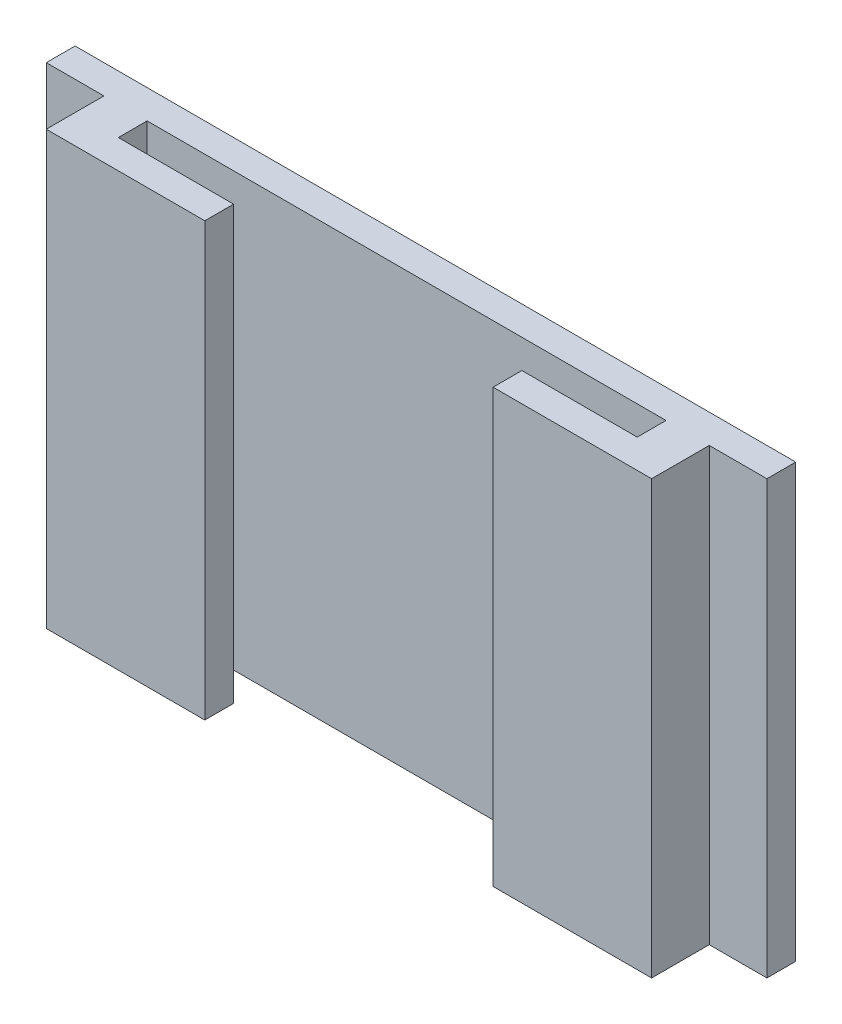
ISO-10303-21;
HEADER;
FILE_DESCRIPTION(('STEP AP214'),'2;1');
FILE_NAME('part.step','',(''),(''),'','','');
FILE_SCHEMA(('AUTOMOTIVE_DESIGN { 1 0 10303 214 1 1 1 1 }'));
ENDSEC;
DATA;
#1=APPLICATION_CONTEXT('core data for automotive mechanical design processes');
#2=APPLICATION_PROTOCOL_DEFINITION('international standard','automotive_design',2000,#1);
#3=PRODUCT_CONTEXT('',#1,'mechanical');
#4=PRODUCT('Part','Part','',(#3));
#5=PRODUCT_RELATED_PRODUCT_CATEGORY('part','',(#4));
#6=PRODUCT_DEFINITION_FORMATION('','',#4);
#7=PRODUCT_DEFINITION_CONTEXT('part definition',#1,'design');
#8=PRODUCT_DEFINITION('design','',#6,#7);
#9=PRODUCT_DEFINITION_SHAPE('','',#8);
#10=(LENGTH_UNIT() NAMED_UNIT(*) SI_UNIT(.MILLI.,.METRE.));
#11=(NAMED_UNIT(*) PLANE_ANGLE_UNIT() SI_UNIT($,.RADIAN.));
#12=(NAMED_UNIT(*) SI_UNIT($,.STERADIAN.) SOLID_ANGLE_UNIT());
#13=UNCERTAINTY_MEASURE_WITH_UNIT(LENGTH_MEASURE(1.E-05),#10,'distance_accuracy_value','');
#14=(GEOMETRIC_REPRESENTATION_CONTEXT(3) GLOBAL_UNCERTAINTY_ASSIGNED_CONTEXT((#13)) GLOBAL_UNIT_ASSIGNED_CONTEXT((#10,
#11,#12)) REPRESENTATION_CONTEXT('',''));
#15=CARTESIAN_POINT('',(0.,0.,0.));
#16=DIRECTION('',(0.,0.,1.));
#17=DIRECTION('',(1.,0.,0.));
#18=AXIS2_PLACEMENT_3D('',#15,#16,#17);
#19=CARTESIAN_POINT('',(0.,0.,3.));
#20=DIRECTION('',(0.,0.,1.));
#21=DIRECTION('',(1.,0.,0.));
#22=AXIS2_PLACEMENT_3D('',#19,#20,#21);
#23=PLANE('',#22);
#24=DIRECTION('',(0.,1.,0.));
#25=VECTOR('',#24,1.);
#26=CARTESIAN_POINT('',(5.,-7.5,3.));
#27=LINE('',#26,#25);
#28=CARTESIAN_POINT('',(5.,-7.5,3.));
#29=VERTEX_POINT('',#28);
#30=CARTESIAN_POINT('',(5.,7.5,3.));
#31=VERTEX_POINT('',#30);
#32=EDGE_CURVE('E213',#29,#31,#27,.T.);
#33=ORIENTED_EDGE('',*,*,#32,.F.);
#34=DIRECTION('',(1.,0.,0.));
#35=VECTOR('',#34,1.);
#36=CARTESIAN_POINT('',(-10.5,-7.5,3.));
#37=LINE('',#36,#35);
#38=CARTESIAN_POINT('',(10.5,-7.5,3.));
#39=VERTEX_POINT('',#38);
#40=EDGE_CURVE('E226',#29,#39,#37,.T.);
#41=ORIENTED_EDGE('',*,*,#40,.T.);
#42=DIRECTION('',(0.,1.,0.));
#43=VECTOR('',#42,1.);
#44=CARTESIAN_POINT('',(10.5,7.5,3.));
#45=LINE('',#44,#43);
#46=CARTESIAN_POINT('',(10.5,7.5,3.));
#47=VERTEX_POINT('',#46);
#48=EDGE_CURVE('E206',#39,#47,#45,.T.);
#49=ORIENTED_EDGE('',*,*,#48,.T.);
#50=DIRECTION('',(-1.,0.,0.));
#51=VECTOR('',#50,1.);
#52=CARTESIAN_POINT('',(-10.5,7.5,3.));
#53=LINE('',#52,#51);
#54=EDGE_CURVE('E221',#47,#31,#53,.T.);
#55=ORIENTED_EDGE('',*,*,#54,.T.);
#56=EDGE_LOOP('',(#33,#41,#49,#55));
#57=FACE_BOUND('',#56,.T.);
#58=ADVANCED_FACE('F37',(#57),#23,.T.);
#59=CARTESIAN_POINT('',(0.,0.,1.));
#60=DIRECTION('',(0.,0.,1.));
#61=DIRECTION('',(1.,0.,0.));
#62=AXIS2_PLACEMENT_3D('',#59,#60,#61);
#63=PLANE('',#62);
#64=DIRECTION('',(-1.,0.,0.));
#65=VECTOR('',#64,1.);
#66=CARTESIAN_POINT('',(-12.5,7.5,1.));
#67=LINE('',#66,#65);
#68=CARTESIAN_POINT('',(12.5,7.5,1.));
#69=VERTEX_POINT('',#68);
#70=CARTESIAN_POINT('',(10.5,7.5,1.));
#71=VERTEX_POINT('',#70);
#72=EDGE_CURVE('E253',#69,#71,#67,.T.);
#73=ORIENTED_EDGE('',*,*,#72,.T.);
#74=DIRECTION('',(0.,-1.,0.));
#75=VECTOR('',#74,1.);
#76=CARTESIAN_POINT('',(10.5,0.,1.));
#77=LINE('',#76,#75);
#78=CARTESIAN_POINT('',(10.5,-7.5,1.));
#79=VERTEX_POINT('',#78);
#80=EDGE_CURVE('E244',#71,#79,#77,.T.);
#81=ORIENTED_EDGE('',*,*,#80,.T.);
#82=DIRECTION('',(1.,0.,0.));
#83=VECTOR('',#82,1.);
#84=CARTESIAN_POINT('',(-12.5,-7.5,1.));
#85=LINE('',#84,#83);
#86=CARTESIAN_POINT('',(12.5,-7.5,1.));
#87=VERTEX_POINT('',#86);
#88=EDGE_CURVE('E257',#79,#87,#85,.T.);
#89=ORIENTED_EDGE('',*,*,#88,.T.);
#90=DIRECTION('',(0.,1.,0.));
#91=VECTOR('',#90,1.);
#92=CARTESIAN_POINT('',(12.5,7.5,1.));
#93=LINE('',#92,#91);
#94=EDGE_CURVE('E248',#87,#69,#93,.T.);
#95=ORIENTED_EDGE('',*,*,#94,.T.);
#96=EDGE_LOOP('',(#73,#81,#89,#95));
#97=FACE_BOUND('',#96,.T.);
#98=ADVANCED_FACE('F291',(#97),#63,.T.);
#99=CARTESIAN_POINT('',(-12.5,-7.5,1.));
#100=VERTEX_POINT('',#99);
#101=CARTESIAN_POINT('',(-10.5,-7.5,1.));
#102=VERTEX_POINT('',#101);
#103=EDGE_CURVE('E60',#100,#102,#85,.T.);
#104=ORIENTED_EDGE('',*,*,#103,.T.);
#105=DIRECTION('',(0.,1.,0.));
#106=VECTOR('',#105,1.);
#107=CARTESIAN_POINT('',(-10.5,0.,1.));
#108=LINE('',#107,#106);
#109=CARTESIAN_POINT('',(-10.5,7.5,1.));
#110=VERTEX_POINT('',#109);
#111=EDGE_CURVE('E242',#102,#110,#108,.T.);
#112=ORIENTED_EDGE('',*,*,#111,.T.);
#113=CARTESIAN_POINT('',(-12.5,7.5,1.));
#114=VERTEX_POINT('',#113);
#115=EDGE_CURVE('E251',#110,#114,#67,.T.);
#116=ORIENTED_EDGE('',*,*,#115,.T.);
#117=DIRECTION('',(0.,-1.,0.));
#118=VECTOR('',#117,1.);
#119=CARTESIAN_POINT('',(-12.5,7.5,1.));
#120=LINE('',#119,#118);
#121=EDGE_CURVE('E255',#114,#100,#120,.T.);
#122=ORIENTED_EDGE('',*,*,#121,.T.);
#123=EDGE_LOOP('',(#104,#112,#116,#122));
#124=FACE_BOUND('',#123,.T.);
#125=ADVANCED_FACE('F322',(#124),#63,.T.);
#126=CARTESIAN_POINT('',(12.5,7.5,1.));
#127=DIRECTION('',(-1.,0.,0.));
#128=DIRECTION('',(0.,-1.,0.));
#129=AXIS2_PLACEMENT_3D('',#126,#127,#128);
#130=PLANE('',#129);
#131=DIRECTION('',(0.,1.,0.));
#132=VECTOR('',#131,1.);
#133=CARTESIAN_POINT('',(12.5,7.5,0.));
#134=LINE('',#133,#132);
#135=CARTESIAN_POINT('',(12.5,-7.5,0.));
#136=VERTEX_POINT('',#135);
#137=CARTESIAN_POINT('',(12.5,7.5,0.));
#138=VERTEX_POINT('',#137);
#139=EDGE_CURVE('E247',#136,#138,#134,.T.);
#140=ORIENTED_EDGE('',*,*,#139,.T.);
#141=DIRECTION('',(0.,0.,-1.));
#142=VECTOR('',#141,1.);
#143=CARTESIAN_POINT('',(12.5,7.5,1.));
#144=LINE('',#143,#142);
#145=EDGE_CURVE('E11',#69,#138,#144,.T.);
#146=ORIENTED_EDGE('',*,*,#145,.F.);
#147=ORIENTED_EDGE('',*,*,#94,.F.);
#148=DIRECTION('',(0.,0.,-1.));
#149=VECTOR('',#148,1.);
#150=CARTESIAN_POINT('',(12.5,-7.5,1.));
#151=LINE('',#150,#149);
#152=EDGE_CURVE('E259',#87,#136,#151,.T.);
#153=ORIENTED_EDGE('',*,*,#152,.T.);
#154=EDGE_LOOP('',(#140,#146,#147,#153));
#155=FACE_BOUND('',#154,.T.);
#156=ADVANCED_FACE('F39',(#155),#130,.F.);
#157=CARTESIAN_POINT('',(-12.5,7.5,1.));
#158=DIRECTION('',(0.,-1.,0.));
#159=DIRECTION('',(0.,0.,-1.));
#160=AXIS2_PLACEMENT_3D('',#157,#158,#159);
#161=PLANE('',#160);
#162=DIRECTION('',(1.,0.,0.));
#163=VECTOR('',#162,1.);
#164=CARTESIAN_POINT('',(5.,7.5,2.));
#165=LINE('',#164,#163);
#166=CARTESIAN_POINT('',(5.,7.5,2.));
#167=VERTEX_POINT('',#166);
#168=CARTESIAN_POINT('',(9.,7.5,2.));
#169=VERTEX_POINT('',#168);
#170=EDGE_CURVE('E180',#167,#169,#165,.T.);
#171=ORIENTED_EDGE('',*,*,#170,.F.);
#172=DIRECTION('',(0.,0.,-1.));
#173=VECTOR('',#172,1.);
#174=CARTESIAN_POINT('',(5.,7.5,2.));
#175=LINE('',#174,#173);
#176=EDGE_CURVE('E175',#31,#167,#175,.T.);
#177=ORIENTED_EDGE('',*,*,#176,.F.);
#178=ORIENTED_EDGE('',*,*,#54,.F.);
#179=DIRECTION('',(0.,0.,-1.));
#180=VECTOR('',#179,1.);
#181=CARTESIAN_POINT('',(10.5,7.5,3.));
#182=LINE('',#181,#180);
#183=EDGE_CURVE('E239',#47,#71,#182,.T.);
#184=ORIENTED_EDGE('',*,*,#183,.T.);
#185=ORIENTED_EDGE('',*,*,#72,.F.);
#186=ORIENTED_EDGE('',*,*,#145,.T.);
#187=DIRECTION('',(-1.,0.,0.));
#188=VECTOR('',#187,1.);
#189=CARTESIAN_POINT('',(-12.5,7.5,0.));
#190=LINE('',#189,#188);
#191=CARTESIAN_POINT('',(-12.5,7.5,0.));
#192=VERTEX_POINT('',#191);
#193=EDGE_CURVE('E262',#138,#192,#190,.T.);
#194=ORIENTED_EDGE('',*,*,#193,.T.);
#195=DIRECTION('',(0.,0.,-1.));
#196=VECTOR('',#195,1.);
#197=CARTESIAN_POINT('',(-12.5,7.5,1.));
#198=LINE('',#197,#196);
#199=EDGE_CURVE('E45',#114,#192,#198,.T.);
#200=ORIENTED_EDGE('',*,*,#199,.F.);
#201=ORIENTED_EDGE('',*,*,#115,.F.);
#202=DIRECTION('',(0.,0.,-1.));
#203=VECTOR('',#202,1.);
#204=CARTESIAN_POINT('',(-10.5,7.5,3.));
#205=LINE('',#204,#203);
#206=CARTESIAN_POINT('',(-10.5,7.5,3.));
#207=VERTEX_POINT('',#206);
#208=EDGE_CURVE('E236',#207,#110,#205,.T.);
#209=ORIENTED_EDGE('',*,*,#208,.F.);
#210=CARTESIAN_POINT('',(-5.,7.5,3.));
#211=VERTEX_POINT('',#210);
#212=EDGE_CURVE('E220',#211,#207,#53,.T.);
#213=ORIENTED_EDGE('',*,*,#212,.F.);
#214=DIRECTION('',(0.,0.,1.));
#215=VECTOR('',#214,1.);
#216=CARTESIAN_POINT('',(-5.,7.5,2.));
#217=LINE('',#216,#215);
#218=CARTESIAN_POINT('',(-5.,7.5,2.));
#219=VERTEX_POINT('',#218);
#220=EDGE_CURVE('E52',#219,#211,#217,.T.);
#221=ORIENTED_EDGE('',*,*,#220,.F.);
#222=DIRECTION('',(1.,0.,0.));
#223=VECTOR('',#222,1.);
#224=CARTESIAN_POINT('',(-9.,7.5,2.));
#225=LINE('',#224,#223);
#226=CARTESIAN_POINT('',(-9.,7.5,2.));
#227=VERTEX_POINT('',#226);
#228=EDGE_CURVE('E154',#227,#219,#225,.T.);
#229=ORIENTED_EDGE('',*,*,#228,.F.);
#230=DIRECTION('',(0.,0.,1.));
#231=VECTOR('',#230,1.);
#232=CARTESIAN_POINT('',(-9.,7.5,2.));
#233=LINE('',#232,#231);
#234=CARTESIAN_POINT('',(-9.,7.5,1.));
#235=VERTEX_POINT('',#234);
#236=EDGE_CURVE('E164',#235,#227,#233,.T.);
#237=ORIENTED_EDGE('',*,*,#236,.F.);
#238=DIRECTION('',(-1.,0.,0.));
#239=VECTOR('',#238,1.);
#240=CARTESIAN_POINT('',(-9.,7.5,1.));
#241=LINE('',#240,#239);
#242=CARTESIAN_POINT('',(9.,7.5,1.));
#243=VERTEX_POINT('',#242);
#244=EDGE_CURVE('E186',#243,#235,#241,.T.);
#245=ORIENTED_EDGE('',*,*,#244,.F.);
#246=DIRECTION('',(0.,0.,-1.));
#247=VECTOR('',#246,1.);
#248=CARTESIAN_POINT('',(9.,7.5,2.));
#249=LINE('',#248,#247);
#250=EDGE_CURVE('E183',#169,#243,#249,.T.);
#251=ORIENTED_EDGE('',*,*,#250,.F.);
#252=EDGE_LOOP('',(#171,#177,#178,#184,#185,#186,#194,#200,#201,#209,#213,#221,#229,#237,#245,#251));
#253=FACE_BOUND('',#252,.T.);
#254=ADVANCED_FACE('F172',(#253),#161,.F.);
#255=CARTESIAN_POINT('',(-12.5,7.5,1.));
#256=DIRECTION('',(1.,0.,0.));
#257=DIRECTION('',(0.,1.,0.));
#258=AXIS2_PLACEMENT_3D('',#255,#256,#257);
#259=PLANE('',#258);
#260=DIRECTION('',(0.,-1.,0.));
#261=VECTOR('',#260,1.);
#262=CARTESIAN_POINT('',(-12.5,7.5,0.));
#263=LINE('',#262,#261);
#264=CARTESIAN_POINT('',(-12.5,-7.5,0.));
#265=VERTEX_POINT('',#264);
#266=EDGE_CURVE('E264',#192,#265,#263,.T.);
#267=ORIENTED_EDGE('',*,*,#266,.T.);
#268=DIRECTION('',(0.,0.,-1.));
#269=VECTOR('',#268,1.);
#270=CARTESIAN_POINT('',(-12.5,-7.5,1.));
#271=LINE('',#270,#269);
#272=EDGE_CURVE('E269',#100,#265,#271,.T.);
#273=ORIENTED_EDGE('',*,*,#272,.F.);
#274=ORIENTED_EDGE('',*,*,#121,.F.);
#275=ORIENTED_EDGE('',*,*,#199,.T.);
#276=EDGE_LOOP('',(#267,#273,#274,#275));
#277=FACE_BOUND('',#276,.T.);
#278=ADVANCED_FACE('F276',(#277),#259,.F.);
#279=CARTESIAN_POINT('',(-12.5,-7.5,1.));
#280=DIRECTION('',(0.,1.,0.));
#281=DIRECTION('',(0.,0.,1.));
#282=AXIS2_PLACEMENT_3D('',#279,#280,#281);
#283=PLANE('',#282);
#284=ORIENTED_EDGE('',*,*,#40,.F.);
#285=DIRECTION('',(0.,0.,-1.));
#286=VECTOR('',#285,1.);
#287=CARTESIAN_POINT('',(5.,-7.5,2.));
#288=LINE('',#287,#286);
#289=CARTESIAN_POINT('',(5.,-7.5,2.));
#290=VERTEX_POINT('',#289);
#291=EDGE_CURVE('E194',#29,#290,#288,.T.);
#292=ORIENTED_EDGE('',*,*,#291,.T.);
#293=DIRECTION('',(1.,0.,0.));
#294=VECTOR('',#293,1.);
#295=CARTESIAN_POINT('',(5.,-7.5,2.));
#296=LINE('',#295,#294);
#297=CARTESIAN_POINT('',(9.,-7.5,2.));
#298=VERTEX_POINT('',#297);
#299=EDGE_CURVE('E197',#290,#298,#296,.T.);
#300=ORIENTED_EDGE('',*,*,#299,.T.);
#301=DIRECTION('',(0.,0.,-1.));
#302=VECTOR('',#301,1.);
#303=CARTESIAN_POINT('',(9.,-7.5,2.));
#304=LINE('',#303,#302);
#305=CARTESIAN_POINT('',(9.,-7.5,1.));
#306=VERTEX_POINT('',#305);
#307=EDGE_CURVE('E200',#298,#306,#304,.T.);
#308=ORIENTED_EDGE('',*,*,#307,.T.);
#309=DIRECTION('',(-1.,0.,0.));
#310=VECTOR('',#309,1.);
#311=CARTESIAN_POINT('',(-9.,-7.5,1.));
#312=LINE('',#311,#310);
#313=CARTESIAN_POINT('',(-9.,-7.5,1.));
#314=VERTEX_POINT('',#313);
#315=EDGE_CURVE('E161',#306,#314,#312,.T.);
#316=ORIENTED_EDGE('',*,*,#315,.T.);
#317=DIRECTION('',(0.,0.,1.));
#318=VECTOR('',#317,1.);
#319=CARTESIAN_POINT('',(-9.,-7.5,2.));
#320=LINE('',#319,#318);
#321=CARTESIAN_POINT('',(-9.,-7.5,2.));
#322=VERTEX_POINT('',#321);
#323=EDGE_CURVE('E188',#314,#322,#320,.T.);
#324=ORIENTED_EDGE('',*,*,#323,.T.);
#325=DIRECTION('',(1.,0.,0.));
#326=VECTOR('',#325,1.);
#327=CARTESIAN_POINT('',(-9.,-7.5,2.));
#328=LINE('',#327,#326);
#329=CARTESIAN_POINT('',(-5.,-7.5,2.));
#330=VERTEX_POINT('',#329);
#331=EDGE_CURVE('E156',#322,#330,#328,.T.);
#332=ORIENTED_EDGE('',*,*,#331,.T.);
#333=DIRECTION('',(0.,0.,1.));
#334=VECTOR('',#333,1.);
#335=CARTESIAN_POINT('',(-5.,-7.5,2.));
#336=LINE('',#335,#334);
#337=CARTESIAN_POINT('',(-5.,-7.5,3.));
#338=VERTEX_POINT('',#337);
#339=EDGE_CURVE('E191',#330,#338,#336,.T.);
#340=ORIENTED_EDGE('',*,*,#339,.T.);
#341=CARTESIAN_POINT('',(-10.5,-7.5,3.));
#342=VERTEX_POINT('',#341);
#343=EDGE_CURVE('E227',#342,#338,#37,.T.);
#344=ORIENTED_EDGE('',*,*,#343,.F.);
#345=DIRECTION('',(0.,0.,-1.));
#346=VECTOR('',#345,1.);
#347=CARTESIAN_POINT('',(-10.5,-7.5,3.));
#348=LINE('',#347,#346);
#349=EDGE_CURVE('E233',#342,#102,#348,.T.);
#350=ORIENTED_EDGE('',*,*,#349,.T.);
#351=ORIENTED_EDGE('',*,*,#103,.F.);
#352=ORIENTED_EDGE('',*,*,#272,.T.);
#353=DIRECTION('',(1.,0.,0.));
#354=VECTOR('',#353,1.);
#355=CARTESIAN_POINT('',(-12.5,-7.5,0.));
#356=LINE('',#355,#354);
#357=EDGE_CURVE('E252',#265,#136,#356,.T.);
#358=ORIENTED_EDGE('',*,*,#357,.T.);
#359=ORIENTED_EDGE('',*,*,#152,.F.);
#360=ORIENTED_EDGE('',*,*,#88,.F.);
#361=DIRECTION('',(0.,0.,-1.));
#362=VECTOR('',#361,1.);
#363=CARTESIAN_POINT('',(10.5,-7.5,3.));
#364=LINE('',#363,#362);
#365=EDGE_CURVE('E230',#39,#79,#364,.T.);
#366=ORIENTED_EDGE('',*,*,#365,.F.);
#367=EDGE_LOOP('',(#284,#292,#300,#308,#316,#324,#332,#340,#344,#350,#351,#352,#358,#359,#360,#366));
#368=FACE_BOUND('',#367,.T.);
#369=ADVANCED_FACE('F286',(#368),#283,.F.);
#370=CARTESIAN_POINT('',(0.,0.,0.));
#371=DIRECTION('',(0.,0.,1.));
#372=DIRECTION('',(1.,0.,0.));
#373=AXIS2_PLACEMENT_3D('',#370,#371,#372);
#374=PLANE('',#373);
#375=ORIENTED_EDGE('',*,*,#266,.F.);
#376=ORIENTED_EDGE('',*,*,#193,.F.);
#377=ORIENTED_EDGE('',*,*,#139,.F.);
#378=ORIENTED_EDGE('',*,*,#357,.F.);
#379=EDGE_LOOP('',(#375,#376,#377,#378));
#380=FACE_BOUND('',#379,.T.);
#381=ADVANCED_FACE('F281',(#380),#374,.F.);
#382=CARTESIAN_POINT('',(10.5,7.5,3.));
#383=DIRECTION('',(-1.,0.,0.));
#384=DIRECTION('',(0.,0.,1.));
#385=AXIS2_PLACEMENT_3D('',#382,#383,#384);
#386=PLANE('',#385);
#387=ORIENTED_EDGE('',*,*,#80,.F.);
#388=ORIENTED_EDGE('',*,*,#183,.F.);
#389=ORIENTED_EDGE('',*,*,#48,.F.);
#390=ORIENTED_EDGE('',*,*,#365,.T.);
#391=EDGE_LOOP('',(#387,#388,#389,#390));
#392=FACE_BOUND('',#391,.T.);
#393=ADVANCED_FACE('F297',(#392),#386,.F.);
#394=CARTESIAN_POINT('',(-10.5,7.5,3.));
#395=DIRECTION('',(1.,0.,0.));
#396=DIRECTION('',(0.,0.,-1.));
#397=AXIS2_PLACEMENT_3D('',#394,#395,#396);
#398=PLANE('',#397);
#399=ORIENTED_EDGE('',*,*,#111,.F.);
#400=ORIENTED_EDGE('',*,*,#349,.F.);
#401=DIRECTION('',(0.,-1.,0.));
#402=VECTOR('',#401,1.);
#403=CARTESIAN_POINT('',(-10.5,7.5,3.));
#404=LINE('',#403,#402);
#405=EDGE_CURVE('E224',#207,#342,#404,.T.);
#406=ORIENTED_EDGE('',*,*,#405,.F.);
#407=ORIENTED_EDGE('',*,*,#208,.T.);
#408=EDGE_LOOP('',(#399,#400,#406,#407));
#409=FACE_BOUND('',#408,.T.);
#410=ADVANCED_FACE('F321',(#409),#398,.F.);
#411=DIRECTION('',(0.,1.,0.));
#412=VECTOR('',#411,1.);
#413=CARTESIAN_POINT('',(-5.,-7.5,3.));
#414=LINE('',#413,#412);
#415=EDGE_CURVE('E215',#338,#211,#414,.T.);
#416=ORIENTED_EDGE('',*,*,#415,.T.);
#417=ORIENTED_EDGE('',*,*,#212,.T.);
#418=ORIENTED_EDGE('',*,*,#405,.T.);
#419=ORIENTED_EDGE('',*,*,#343,.T.);
#420=EDGE_LOOP('',(#416,#417,#418,#419));
#421=FACE_BOUND('',#420,.T.);
#422=ADVANCED_FACE('F316',(#421),#23,.T.);
#423=CARTESIAN_POINT('',(-9.,-7.5,2.));
#424=DIRECTION('',(-1.,0.,0.));
#425=DIRECTION('',(0.,0.,1.));
#426=AXIS2_PLACEMENT_3D('',#423,#424,#425);
#427=PLANE('',#426);
#428=DIRECTION('',(0.,1.,0.));
#429=VECTOR('',#428,1.);
#430=CARTESIAN_POINT('',(-9.,-7.5,2.));
#431=LINE('',#430,#429);
#432=EDGE_CURVE('E150',#322,#227,#431,.T.);
#433=ORIENTED_EDGE('',*,*,#432,.F.);
#434=ORIENTED_EDGE('',*,*,#323,.F.);
#435=DIRECTION('',(0.,1.,0.));
#436=VECTOR('',#435,1.);
#437=CARTESIAN_POINT('',(-9.,-7.5,1.));
#438=LINE('',#437,#436);
#439=EDGE_CURVE('E166',#314,#235,#438,.T.);
#440=ORIENTED_EDGE('',*,*,#439,.T.);
#441=ORIENTED_EDGE('',*,*,#236,.T.);
#442=EDGE_LOOP('',(#433,#434,#440,#441));
#443=FACE_BOUND('',#442,.T.);
#444=ADVANCED_FACE('F165',(#443),#427,.F.);
#445=CARTESIAN_POINT('',(-9.,-7.5,1.));
#446=DIRECTION('',(0.,0.,-1.));
#447=DIRECTION('',(-1.,0.,0.));
#448=AXIS2_PLACEMENT_3D('',#445,#446,#447);
#449=PLANE('',#448);
#450=ORIENTED_EDGE('',*,*,#439,.F.);
#451=ORIENTED_EDGE('',*,*,#315,.F.);
#452=DIRECTION('',(0.,1.,0.));
#453=VECTOR('',#452,1.);
#454=CARTESIAN_POINT('',(9.,-7.5,1.));
#455=LINE('',#454,#453);
#456=EDGE_CURVE('E207',#306,#243,#455,.T.);
#457=ORIENTED_EDGE('',*,*,#456,.T.);
#458=ORIENTED_EDGE('',*,*,#244,.T.);
#459=EDGE_LOOP('',(#450,#451,#457,#458));
#460=FACE_BOUND('',#459,.T.);
#461=ADVANCED_FACE('F312',(#460),#449,.F.);
#462=CARTESIAN_POINT('',(9.,-7.5,2.));
#463=DIRECTION('',(1.,0.,0.));
#464=DIRECTION('',(0.,0.,-1.));
#465=AXIS2_PLACEMENT_3D('',#462,#463,#464);
#466=PLANE('',#465);
#467=ORIENTED_EDGE('',*,*,#456,.F.);
#468=ORIENTED_EDGE('',*,*,#307,.F.);
#469=DIRECTION('',(0.,1.,0.));
#470=VECTOR('',#469,1.);
#471=CARTESIAN_POINT('',(9.,-7.5,2.));
#472=LINE('',#471,#470);
#473=EDGE_CURVE('E209',#298,#169,#472,.T.);
#474=ORIENTED_EDGE('',*,*,#473,.T.);
#475=ORIENTED_EDGE('',*,*,#250,.T.);
#476=EDGE_LOOP('',(#467,#468,#474,#475));
#477=FACE_BOUND('',#476,.T.);
#478=ADVANCED_FACE('F310',(#477),#466,.F.);
#479=CARTESIAN_POINT('',(5.,-7.5,2.));
#480=DIRECTION('',(0.,0.,1.));
#481=DIRECTION('',(1.,0.,0.));
#482=AXIS2_PLACEMENT_3D('',#479,#480,#481);
#483=PLANE('',#482);
#484=ORIENTED_EDGE('',*,*,#473,.F.);
#485=ORIENTED_EDGE('',*,*,#299,.F.);
#486=DIRECTION('',(0.,1.,0.));
#487=VECTOR('',#486,1.);
#488=CARTESIAN_POINT('',(5.,-7.5,2.));
#489=LINE('',#488,#487);
#490=EDGE_CURVE('E211',#290,#167,#489,.T.);
#491=ORIENTED_EDGE('',*,*,#490,.T.);
#492=ORIENTED_EDGE('',*,*,#170,.T.);
#493=EDGE_LOOP('',(#484,#485,#491,#492));
#494=FACE_BOUND('',#493,.T.);
#495=ADVANCED_FACE('F305',(#494),#483,.F.);
#496=CARTESIAN_POINT('',(5.,-7.5,2.));
#497=DIRECTION('',(1.,0.,0.));
#498=DIRECTION('',(0.,0.,-1.));
#499=AXIS2_PLACEMENT_3D('',#496,#497,#498);
#500=PLANE('',#499);
#501=ORIENTED_EDGE('',*,*,#490,.F.);
#502=ORIENTED_EDGE('',*,*,#291,.F.);
#503=ORIENTED_EDGE('',*,*,#32,.T.);
#504=ORIENTED_EDGE('',*,*,#176,.T.);
#505=EDGE_LOOP('',(#501,#502,#503,#504));
#506=FACE_BOUND('',#505,.T.);
#507=ADVANCED_FACE('F302',(#506),#500,.F.);
#508=CARTESIAN_POINT('',(-5.,-7.5,2.));
#509=DIRECTION('',(-1.,0.,0.));
#510=DIRECTION('',(0.,0.,1.));
#511=AXIS2_PLACEMENT_3D('',#508,#509,#510);
#512=PLANE('',#511);
#513=ORIENTED_EDGE('',*,*,#415,.F.);
#514=ORIENTED_EDGE('',*,*,#339,.F.);
#515=DIRECTION('',(0.,1.,0.));
#516=VECTOR('',#515,1.);
#517=CARTESIAN_POINT('',(-5.,-7.5,2.));
#518=LINE('',#517,#516);
#519=EDGE_CURVE('E160',#330,#219,#518,.T.);
#520=ORIENTED_EDGE('',*,*,#519,.T.);
#521=ORIENTED_EDGE('',*,*,#220,.T.);
#522=EDGE_LOOP('',(#513,#514,#520,#521));
#523=FACE_BOUND('',#522,.T.);
#524=ADVANCED_FACE('F420',(#523),#512,.F.);
#525=CARTESIAN_POINT('',(-9.,-7.5,2.));
#526=DIRECTION('',(0.,0.,1.));
#527=DIRECTION('',(1.,0.,0.));
#528=AXIS2_PLACEMENT_3D('',#525,#526,#527);
#529=PLANE('',#528);
#530=ORIENTED_EDGE('',*,*,#519,.F.);
#531=ORIENTED_EDGE('',*,*,#331,.F.);
#532=ORIENTED_EDGE('',*,*,#432,.T.);
#533=ORIENTED_EDGE('',*,*,#228,.T.);
#534=EDGE_LOOP('',(#530,#531,#532,#533));
#535=FACE_BOUND('',#534,.T.);
#536=ADVANCED_FACE('F152',(#535),#529,.F.);
#537=CLOSED_SHELL('',(#58,#98,#125,#156,#254,#278,#369,#381,#393,#410,#422,#444,#461,#478,#495,
#507,#524,#536));
#538=MANIFOLD_SOLID_BREP('B2',#537);
#539=ADVANCED_BREP_SHAPE_REPRESENTATION('',(#18,#538),#14);
#540=SHAPE_DEFINITION_REPRESENTATION(#9,#539);
ENDSEC;
END-ISO-10303-21;
